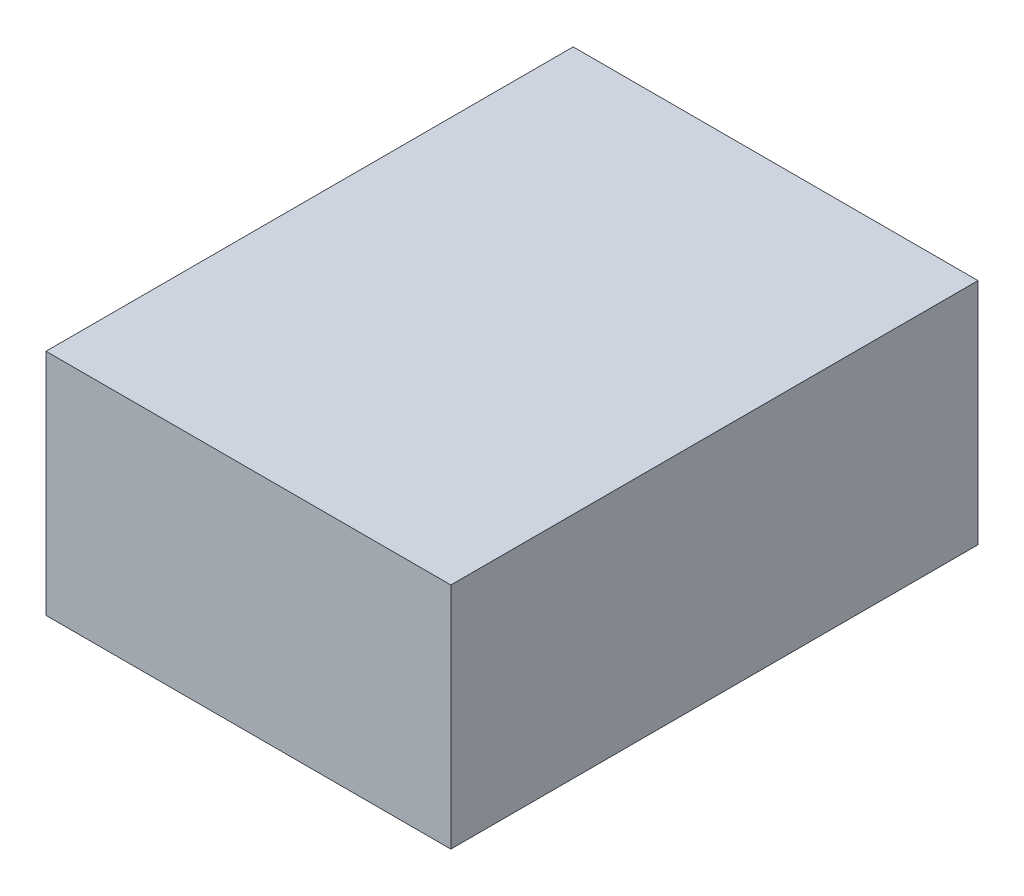
ISO-10303-21;
HEADER;
FILE_DESCRIPTION(('STEP AP214'),'2;1');
FILE_NAME('part.step','',(''),(''),'','','');
FILE_SCHEMA(('AUTOMOTIVE_DESIGN { 1 0 10303 214 1 1 1 1 }'));
ENDSEC;
DATA;
#1=APPLICATION_CONTEXT('core data for automotive mechanical design processes');
#2=APPLICATION_PROTOCOL_DEFINITION('international standard','automotive_design',2000,#1);
#3=PRODUCT_CONTEXT('',#1,'mechanical');
#4=PRODUCT('Part','Part','',(#3));
#5=PRODUCT_RELATED_PRODUCT_CATEGORY('part','',(#4));
#6=PRODUCT_DEFINITION_FORMATION('','',#4);
#7=PRODUCT_DEFINITION_CONTEXT('part definition',#1,'design');
#8=PRODUCT_DEFINITION('design','',#6,#7);
#9=PRODUCT_DEFINITION_SHAPE('','',#8);
#10=(LENGTH_UNIT() NAMED_UNIT(*) SI_UNIT(.MILLI.,.METRE.));
#11=(NAMED_UNIT(*) PLANE_ANGLE_UNIT() SI_UNIT($,.RADIAN.));
#12=(NAMED_UNIT(*) SI_UNIT($,.STERADIAN.) SOLID_ANGLE_UNIT());
#13=UNCERTAINTY_MEASURE_WITH_UNIT(LENGTH_MEASURE(1.E-05),#10,'distance_accuracy_value','');
#14=(GEOMETRIC_REPRESENTATION_CONTEXT(3) GLOBAL_UNCERTAINTY_ASSIGNED_CONTEXT((#13)) GLOBAL_UNIT_ASSIGNED_CONTEXT((#10,
#11,#12)) REPRESENTATION_CONTEXT('',''));
#15=CARTESIAN_POINT('',(0.,0.,0.));
#16=DIRECTION('',(0.,0.,1.));
#17=DIRECTION('',(1.,0.,0.));
#18=AXIS2_PLACEMENT_3D('',#15,#16,#17);
#19=CARTESIAN_POINT('',(51.689,29.21,-67.31));
#20=DIRECTION('',(1.,0.,0.));
#21=DIRECTION('',(0.,0.,-1.));
#22=AXIS2_PLACEMENT_3D('',#19,#20,#21);
#23=PLANE('',#22);
#24=DIRECTION('',(0.,0.,1.));
#25=VECTOR('',#24,1.);
#26=CARTESIAN_POINT('',(51.689,29.21,-67.31));
#27=LINE('',#26,#25);
#28=CARTESIAN_POINT('',(51.689,29.21,-67.31));
#29=VERTEX_POINT('',#28);
#30=CARTESIAN_POINT('',(51.689,29.21,67.31));
#31=VERTEX_POINT('',#30);
#32=EDGE_CURVE('E38',#29,#31,#27,.T.);
#33=ORIENTED_EDGE('',*,*,#32,.T.);
#34=DIRECTION('',(0.,1.,0.));
#35=VECTOR('',#34,1.);
#36=CARTESIAN_POINT('',(51.689,29.21,67.31));
#37=LINE('',#36,#35);
#38=CARTESIAN_POINT('',(51.689,-29.21,67.31));
#39=VERTEX_POINT('',#38);
#40=EDGE_CURVE('E75',#39,#31,#37,.T.);
#41=ORIENTED_EDGE('',*,*,#40,.F.);
#42=DIRECTION('',(0.,0.,1.));
#43=VECTOR('',#42,1.);
#44=CARTESIAN_POINT('',(51.689,-29.21,-67.31));
#45=LINE('',#44,#43);
#46=CARTESIAN_POINT('',(51.689,-29.21,-67.31));
#47=VERTEX_POINT('',#46);
#48=EDGE_CURVE('E11',#47,#39,#45,.T.);
#49=ORIENTED_EDGE('',*,*,#48,.F.);
#50=DIRECTION('',(0.,1.,0.));
#51=VECTOR('',#50,1.);
#52=CARTESIAN_POINT('',(51.689,29.21,-67.31));
#53=LINE('',#52,#51);
#54=EDGE_CURVE('E76',#47,#29,#53,.T.);
#55=ORIENTED_EDGE('',*,*,#54,.T.);
#56=EDGE_LOOP('',(#33,#41,#49,#55));
#57=FACE_BOUND('',#56,.T.);
#58=ADVANCED_FACE('F35',(#57),#23,.T.);
#59=CARTESIAN_POINT('',(-51.689,-29.21,-67.31));
#60=DIRECTION('',(0.,-1.,0.));
#61=DIRECTION('',(0.,0.,-1.));
#62=AXIS2_PLACEMENT_3D('',#59,#60,#61);
#63=PLANE('',#62);
#64=ORIENTED_EDGE('',*,*,#48,.T.);
#65=DIRECTION('',(1.,0.,0.));
#66=VECTOR('',#65,1.);
#67=CARTESIAN_POINT('',(-51.689,-29.21,67.31));
#68=LINE('',#67,#66);
#69=CARTESIAN_POINT('',(-51.689,-29.21,67.31));
#70=VERTEX_POINT('',#69);
#71=EDGE_CURVE('E92',#70,#39,#68,.T.);
#72=ORIENTED_EDGE('',*,*,#71,.F.);
#73=DIRECTION('',(0.,0.,1.));
#74=VECTOR('',#73,1.);
#75=CARTESIAN_POINT('',(-51.689,-29.21,-67.31));
#76=LINE('',#75,#74);
#77=CARTESIAN_POINT('',(-51.689,-29.21,-67.31));
#78=VERTEX_POINT('',#77);
#79=EDGE_CURVE('E43',#78,#70,#76,.T.);
#80=ORIENTED_EDGE('',*,*,#79,.F.);
#81=DIRECTION('',(1.,0.,0.));
#82=VECTOR('',#81,1.);
#83=CARTESIAN_POINT('',(-51.689,-29.21,-67.31));
#84=LINE('',#83,#82);
#85=EDGE_CURVE('E81',#78,#47,#84,.T.);
#86=ORIENTED_EDGE('',*,*,#85,.T.);
#87=EDGE_LOOP('',(#64,#72,#80,#86));
#88=FACE_BOUND('',#87,.T.);
#89=ADVANCED_FACE('F107',(#88),#63,.T.);
#90=CARTESIAN_POINT('',(-51.689,29.21,-67.31));
#91=DIRECTION('',(-1.,0.,0.));
#92=DIRECTION('',(0.,-1.,0.));
#93=AXIS2_PLACEMENT_3D('',#90,#91,#92);
#94=PLANE('',#93);
#95=ORIENTED_EDGE('',*,*,#79,.T.);
#96=DIRECTION('',(0.,-1.,0.));
#97=VECTOR('',#96,1.);
#98=CARTESIAN_POINT('',(-51.689,29.21,67.31));
#99=LINE('',#98,#97);
#100=CARTESIAN_POINT('',(-51.689,29.21,67.31));
#101=VERTEX_POINT('',#100);
#102=EDGE_CURVE('E88',#101,#70,#99,.T.);
#103=ORIENTED_EDGE('',*,*,#102,.F.);
#104=DIRECTION('',(0.,0.,1.));
#105=VECTOR('',#104,1.);
#106=CARTESIAN_POINT('',(-51.689,29.21,-67.31));
#107=LINE('',#106,#105);
#108=CARTESIAN_POINT('',(-51.689,29.21,-67.31));
#109=VERTEX_POINT('',#108);
#110=EDGE_CURVE('E80',#109,#101,#107,.T.);
#111=ORIENTED_EDGE('',*,*,#110,.F.);
#112=DIRECTION('',(0.,-1.,0.));
#113=VECTOR('',#112,1.);
#114=CARTESIAN_POINT('',(-51.689,29.21,-67.31));
#115=LINE('',#114,#113);
#116=EDGE_CURVE('E100',#109,#78,#115,.T.);
#117=ORIENTED_EDGE('',*,*,#116,.T.);
#118=EDGE_LOOP('',(#95,#103,#111,#117));
#119=FACE_BOUND('',#118,.T.);
#120=ADVANCED_FACE('F104',(#119),#94,.T.);
#121=CARTESIAN_POINT('',(-51.689,29.21,-67.31));
#122=DIRECTION('',(0.,1.,0.));
#123=DIRECTION('',(0.,0.,1.));
#124=AXIS2_PLACEMENT_3D('',#121,#122,#123);
#125=PLANE('',#124);
#126=ORIENTED_EDGE('',*,*,#110,.T.);
#127=DIRECTION('',(-1.,0.,0.));
#128=VECTOR('',#127,1.);
#129=CARTESIAN_POINT('',(-51.689,29.21,67.31));
#130=LINE('',#129,#128);
#131=EDGE_CURVE('E83',#31,#101,#130,.T.);
#132=ORIENTED_EDGE('',*,*,#131,.F.);
#133=ORIENTED_EDGE('',*,*,#32,.F.);
#134=DIRECTION('',(-1.,0.,0.));
#135=VECTOR('',#134,1.);
#136=CARTESIAN_POINT('',(-51.689,29.21,-67.31));
#137=LINE('',#136,#135);
#138=EDGE_CURVE('E98',#29,#109,#137,.T.);
#139=ORIENTED_EDGE('',*,*,#138,.T.);
#140=EDGE_LOOP('',(#126,#132,#133,#139));
#141=FACE_BOUND('',#140,.T.);
#142=ADVANCED_FACE('F84',(#141),#125,.T.);
#143=CARTESIAN_POINT('',(0.,0.,-67.31));
#144=DIRECTION('',(0.,0.,1.));
#145=DIRECTION('',(1.,0.,0.));
#146=AXIS2_PLACEMENT_3D('',#143,#144,#145);
#147=PLANE('',#146);
#148=ORIENTED_EDGE('',*,*,#54,.F.);
#149=ORIENTED_EDGE('',*,*,#85,.F.);
#150=ORIENTED_EDGE('',*,*,#116,.F.);
#151=ORIENTED_EDGE('',*,*,#138,.F.);
#152=EDGE_LOOP('',(#148,#149,#150,#151));
#153=FACE_BOUND('',#152,.T.);
#154=ADVANCED_FACE('F109',(#153),#147,.F.);
#155=CARTESIAN_POINT('',(0.,0.,67.31));
#156=DIRECTION('',(0.,0.,1.));
#157=DIRECTION('',(1.,0.,0.));
#158=AXIS2_PLACEMENT_3D('',#155,#156,#157);
#159=PLANE('',#158);
#160=ORIENTED_EDGE('',*,*,#40,.T.);
#161=ORIENTED_EDGE('',*,*,#131,.T.);
#162=ORIENTED_EDGE('',*,*,#102,.T.);
#163=ORIENTED_EDGE('',*,*,#71,.T.);
#164=EDGE_LOOP('',(#160,#161,#162,#163));
#165=FACE_BOUND('',#164,.T.);
#166=ADVANCED_FACE('F91',(#165),#159,.T.);
#167=CLOSED_SHELL('',(#58,#89,#120,#142,#154,#166));
#168=MANIFOLD_SOLID_BREP('B2',#167);
#169=ADVANCED_BREP_SHAPE_REPRESENTATION('',(#18,#168),#14);
#170=SHAPE_DEFINITION_REPRESENTATION(#9,#169);
ENDSEC;
END-ISO-10303-21;
